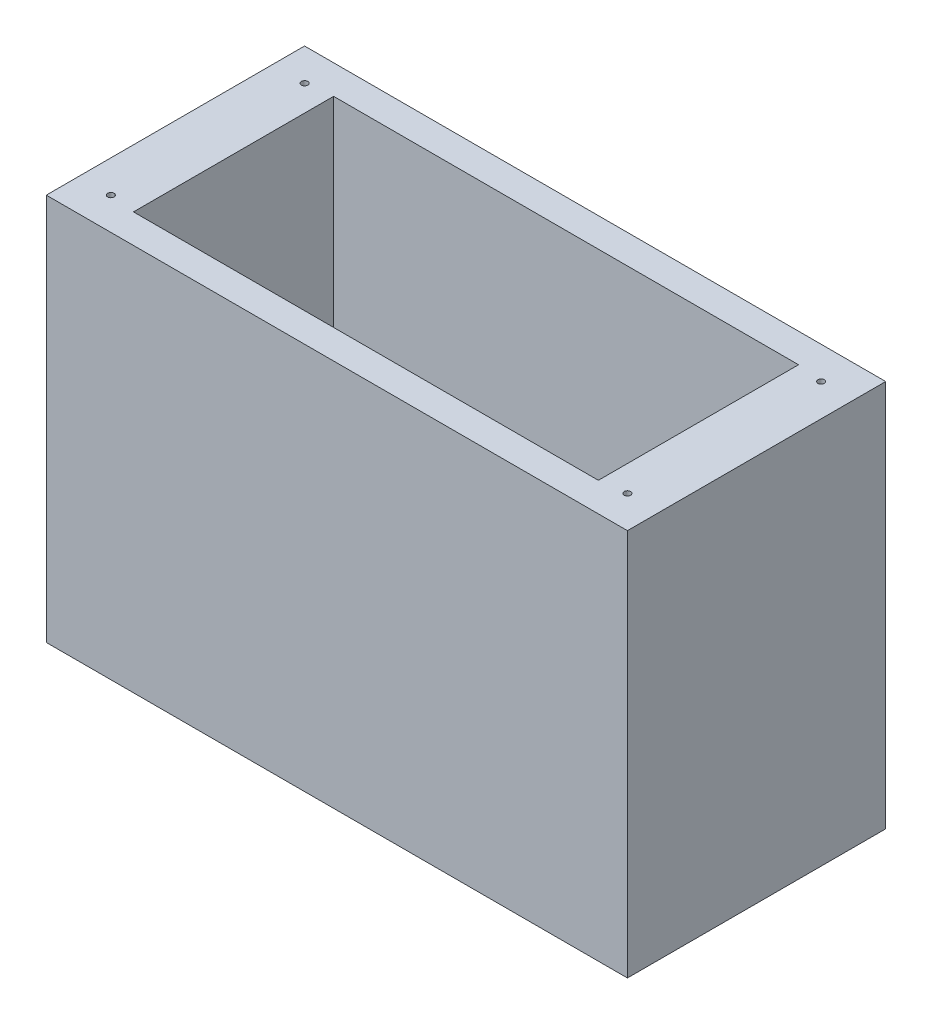
ISO-10303-21;
HEADER;
FILE_DESCRIPTION(('STEP AP214'),'2;1');
FILE_NAME('part.step','',(''),(''),'','','');
FILE_SCHEMA(('AUTOMOTIVE_DESIGN { 1 0 10303 214 1 1 1 1 }'));
ENDSEC;
DATA;
#1=APPLICATION_CONTEXT('core data for automotive mechanical design processes');
#2=APPLICATION_PROTOCOL_DEFINITION('international standard','automotive_design',2000,#1);
#3=PRODUCT_CONTEXT('',#1,'mechanical');
#4=PRODUCT('Part','Part','',(#3));
#5=PRODUCT_RELATED_PRODUCT_CATEGORY('part','',(#4));
#6=PRODUCT_DEFINITION_FORMATION('','',#4);
#7=PRODUCT_DEFINITION_CONTEXT('part definition',#1,'design');
#8=PRODUCT_DEFINITION('design','',#6,#7);
#9=PRODUCT_DEFINITION_SHAPE('','',#8);
#10=(LENGTH_UNIT() NAMED_UNIT(*) SI_UNIT(.MILLI.,.METRE.));
#11=(NAMED_UNIT(*) PLANE_ANGLE_UNIT() SI_UNIT($,.RADIAN.));
#12=(NAMED_UNIT(*) SI_UNIT($,.STERADIAN.) SOLID_ANGLE_UNIT());
#13=UNCERTAINTY_MEASURE_WITH_UNIT(LENGTH_MEASURE(1.E-05),#10,'distance_accuracy_value','');
#14=(GEOMETRIC_REPRESENTATION_CONTEXT(3) GLOBAL_UNCERTAINTY_ASSIGNED_CONTEXT((#13)) GLOBAL_UNIT_ASSIGNED_CONTEXT((#10,
#11,#12)) REPRESENTATION_CONTEXT('',''));
#15=CARTESIAN_POINT('',(0.,0.,0.));
#16=DIRECTION('',(0.,0.,1.));
#17=DIRECTION('',(1.,0.,0.));
#18=AXIS2_PLACEMENT_3D('',#15,#16,#17);
#19=CARTESIAN_POINT('',(0.,152.4,0.));
#20=DIRECTION('',(1.,0.,0.));
#21=DIRECTION('',(0.,0.,-1.));
#22=AXIS2_PLACEMENT_3D('',#19,#20,#21);
#23=PLANE('',#22);
#24=DIRECTION('',(0.,0.,1.));
#25=VECTOR('',#24,1.);
#26=CARTESIAN_POINT('',(0.,0.,0.));
#27=LINE('',#26,#25);
#28=CARTESIAN_POINT('',(0.,0.,-101.6));
#29=VERTEX_POINT('',#28);
#30=CARTESIAN_POINT('',(0.,0.,0.));
#31=VERTEX_POINT('',#30);
#32=EDGE_CURVE('E144',#29,#31,#27,.T.);
#33=ORIENTED_EDGE('',*,*,#32,.T.);
#34=DIRECTION('',(0.,-1.,0.));
#35=VECTOR('',#34,1.);
#36=CARTESIAN_POINT('',(0.,152.4,0.));
#37=LINE('',#36,#35);
#38=CARTESIAN_POINT('',(0.,152.4,0.));
#39=VERTEX_POINT('',#38);
#40=EDGE_CURVE('E11',#39,#31,#37,.T.);
#41=ORIENTED_EDGE('',*,*,#40,.F.);
#42=DIRECTION('',(0.,0.,1.));
#43=VECTOR('',#42,1.);
#44=CARTESIAN_POINT('',(0.,152.4,0.));
#45=LINE('',#44,#43);
#46=CARTESIAN_POINT('',(0.,152.4,-101.6));
#47=VERTEX_POINT('',#46);
#48=EDGE_CURVE('E148',#47,#39,#45,.T.);
#49=ORIENTED_EDGE('',*,*,#48,.F.);
#50=DIRECTION('',(0.,-1.,0.));
#51=VECTOR('',#50,1.);
#52=CARTESIAN_POINT('',(0.,152.4,-101.6));
#53=LINE('',#52,#51);
#54=EDGE_CURVE('E154',#47,#29,#53,.T.);
#55=ORIENTED_EDGE('',*,*,#54,.T.);
#56=EDGE_LOOP('',(#33,#41,#49,#55));
#57=FACE_BOUND('',#56,.T.);
#58=ADVANCED_FACE('F32',(#57),#23,.F.);
#59=CARTESIAN_POINT('',(0.,152.4,0.));
#60=DIRECTION('',(0.,0.,-1.));
#61=DIRECTION('',(-1.,0.,0.));
#62=AXIS2_PLACEMENT_3D('',#59,#60,#61);
#63=PLANE('',#62);
#64=DIRECTION('',(1.,0.,0.));
#65=VECTOR('',#64,1.);
#66=CARTESIAN_POINT('',(0.,0.,0.));
#67=LINE('',#66,#65);
#68=CARTESIAN_POINT('',(228.6,0.,0.));
#69=VERTEX_POINT('',#68);
#70=EDGE_CURVE('E157',#31,#69,#67,.T.);
#71=ORIENTED_EDGE('',*,*,#70,.T.);
#72=DIRECTION('',(0.,-1.,0.));
#73=VECTOR('',#72,1.);
#74=CARTESIAN_POINT('',(228.6,152.4,0.));
#75=LINE('',#74,#73);
#76=CARTESIAN_POINT('',(228.6,152.4,0.));
#77=VERTEX_POINT('',#76);
#78=EDGE_CURVE('E39',#77,#69,#75,.T.);
#79=ORIENTED_EDGE('',*,*,#78,.F.);
#80=DIRECTION('',(1.,0.,0.));
#81=VECTOR('',#80,1.);
#82=CARTESIAN_POINT('',(0.,152.4,0.));
#83=LINE('',#82,#81);
#84=EDGE_CURVE('E83',#39,#77,#83,.T.);
#85=ORIENTED_EDGE('',*,*,#84,.F.);
#86=ORIENTED_EDGE('',*,*,#40,.T.);
#87=EDGE_LOOP('',(#71,#79,#85,#86));
#88=FACE_BOUND('',#87,.T.);
#89=ADVANCED_FACE('F186',(#88),#63,.F.);
#90=CARTESIAN_POINT('',(228.6,152.4,0.));
#91=DIRECTION('',(-1.,0.,0.));
#92=DIRECTION('',(0.,0.,1.));
#93=AXIS2_PLACEMENT_3D('',#90,#91,#92);
#94=PLANE('',#93);
#95=DIRECTION('',(0.,0.,-1.));
#96=VECTOR('',#95,1.);
#97=CARTESIAN_POINT('',(228.6,0.,0.));
#98=LINE('',#97,#96);
#99=CARTESIAN_POINT('',(228.6,0.,-101.6));
#100=VERTEX_POINT('',#99);
#101=EDGE_CURVE('E159',#69,#100,#98,.T.);
#102=ORIENTED_EDGE('',*,*,#101,.T.);
#103=DIRECTION('',(0.,-1.,0.));
#104=VECTOR('',#103,1.);
#105=CARTESIAN_POINT('',(228.6,152.4,-101.6));
#106=LINE('',#105,#104);
#107=CARTESIAN_POINT('',(228.6,152.4,-101.6));
#108=VERTEX_POINT('',#107);
#109=EDGE_CURVE('E163',#108,#100,#106,.T.);
#110=ORIENTED_EDGE('',*,*,#109,.F.);
#111=DIRECTION('',(0.,0.,-1.));
#112=VECTOR('',#111,1.);
#113=CARTESIAN_POINT('',(228.6,152.4,0.));
#114=LINE('',#113,#112);
#115=EDGE_CURVE('E151',#77,#108,#114,.T.);
#116=ORIENTED_EDGE('',*,*,#115,.F.);
#117=ORIENTED_EDGE('',*,*,#78,.T.);
#118=EDGE_LOOP('',(#102,#110,#116,#117));
#119=FACE_BOUND('',#118,.T.);
#120=ADVANCED_FACE('F168',(#119),#94,.F.);
#121=CARTESIAN_POINT('',(0.,152.4,-101.6));
#122=DIRECTION('',(0.,0.,1.));
#123=DIRECTION('',(1.,0.,0.));
#124=AXIS2_PLACEMENT_3D('',#121,#122,#123);
#125=PLANE('',#124);
#126=DIRECTION('',(-1.,0.,0.));
#127=VECTOR('',#126,1.);
#128=CARTESIAN_POINT('',(0.,0.,-101.6));
#129=LINE('',#128,#127);
#130=EDGE_CURVE('E76',#100,#29,#129,.T.);
#131=ORIENTED_EDGE('',*,*,#130,.T.);
#132=ORIENTED_EDGE('',*,*,#54,.F.);
#133=DIRECTION('',(-1.,0.,0.));
#134=VECTOR('',#133,1.);
#135=CARTESIAN_POINT('',(0.,152.4,-101.6));
#136=LINE('',#135,#134);
#137=EDGE_CURVE('E55',#108,#47,#136,.T.);
#138=ORIENTED_EDGE('',*,*,#137,.F.);
#139=ORIENTED_EDGE('',*,*,#109,.T.);
#140=EDGE_LOOP('',(#131,#132,#138,#139));
#141=FACE_BOUND('',#140,.T.);
#142=ADVANCED_FACE('F176',(#141),#125,.F.);
#143=CARTESIAN_POINT('',(0.,152.4,0.));
#144=DIRECTION('',(0.,-1.,0.));
#145=DIRECTION('',(0.,0.,-1.));
#146=AXIS2_PLACEMENT_3D('',#143,#144,#145);
#147=PLANE('',#146);
#148=CARTESIAN_POINT('',(215.9,152.4,-88.8999999999999));
#149=DIRECTION('',(0.,1.,0.));
#150=DIRECTION('',(0.,0.,-1.));
#151=AXIS2_PLACEMENT_3D('',#148,#149,#150);
#152=CIRCLE('',#151,1.27000000000001);
#153=CARTESIAN_POINT('',(215.9,152.4,-90.17));
#154=VERTEX_POINT('',#153);
#155=EDGE_CURVE('E311',#154,#154,#152,.T.);
#156=ORIENTED_EDGE('',*,*,#155,.F.);
#157=EDGE_LOOP('',(#156));
#158=FACE_BOUND('',#157,.T.);
#159=CARTESIAN_POINT('',(12.7,152.4,-12.7));
#160=DIRECTION('',(0.,1.,0.));
#161=DIRECTION('',(0.,0.,-1.));
#162=AXIS2_PLACEMENT_3D('',#159,#160,#161);
#163=CIRCLE('',#162,1.27);
#164=CARTESIAN_POINT('',(12.7,152.4,-13.97));
#165=VERTEX_POINT('',#164);
#166=EDGE_CURVE('E316',#165,#165,#163,.T.);
#167=ORIENTED_EDGE('',*,*,#166,.F.);
#168=EDGE_LOOP('',(#167));
#169=FACE_BOUND('',#168,.T.);
#170=CARTESIAN_POINT('',(215.9,152.4,-12.7));
#171=DIRECTION('',(0.,1.,0.));
#172=DIRECTION('',(0.,0.,1.));
#173=AXIS2_PLACEMENT_3D('',#170,#171,#172);
#174=CIRCLE('',#173,1.27000000000001);
#175=CARTESIAN_POINT('',(215.9,152.4,-11.43));
#176=VERTEX_POINT('',#175);
#177=EDGE_CURVE('E335',#176,#176,#174,.T.);
#178=ORIENTED_EDGE('',*,*,#177,.F.);
#179=EDGE_LOOP('',(#178));
#180=FACE_BOUND('',#179,.T.);
#181=CARTESIAN_POINT('',(12.7,152.4,-88.8999999999999));
#182=DIRECTION('',(0.,1.,0.));
#183=DIRECTION('',(0.,0.,1.));
#184=AXIS2_PLACEMENT_3D('',#181,#182,#183);
#185=CIRCLE('',#184,1.27);
#186=CARTESIAN_POINT('',(12.7,152.4,-87.6299999999999));
#187=VERTEX_POINT('',#186);
#188=EDGE_CURVE('E131',#187,#187,#185,.T.);
#189=ORIENTED_EDGE('',*,*,#188,.F.);
#190=EDGE_LOOP('',(#189));
#191=FACE_BOUND('',#190,.T.);
#192=DIRECTION('',(1.,0.,0.));
#193=VECTOR('',#192,1.);
#194=CARTESIAN_POINT('',(22.86,152.4,-11.43));
#195=LINE('',#194,#193);
#196=CARTESIAN_POINT('',(22.86,152.4,-11.43));
#197=VERTEX_POINT('',#196);
#198=CARTESIAN_POINT('',(205.74,152.4,-11.43));
#199=VERTEX_POINT('',#198);
#200=EDGE_CURVE('E137',#197,#199,#195,.T.);
#201=ORIENTED_EDGE('',*,*,#200,.F.);
#202=DIRECTION('',(0.,0.,1.));
#203=VECTOR('',#202,1.);
#204=CARTESIAN_POINT('',(22.86,152.4,-90.17));
#205=LINE('',#204,#203);
#206=CARTESIAN_POINT('',(22.86,152.4,-90.17));
#207=VERTEX_POINT('',#206);
#208=EDGE_CURVE('E46',#207,#197,#205,.T.);
#209=ORIENTED_EDGE('',*,*,#208,.F.);
#210=DIRECTION('',(-1.,0.,0.));
#211=VECTOR('',#210,1.);
#212=CARTESIAN_POINT('',(22.86,152.4,-90.17));
#213=LINE('',#212,#211);
#214=CARTESIAN_POINT('',(205.74,152.4,-90.17));
#215=VERTEX_POINT('',#214);
#216=EDGE_CURVE('E125',#215,#207,#213,.T.);
#217=ORIENTED_EDGE('',*,*,#216,.F.);
#218=DIRECTION('',(0.,0.,-1.));
#219=VECTOR('',#218,1.);
#220=CARTESIAN_POINT('',(205.74,152.4,-90.17));
#221=LINE('',#220,#219);
#222=EDGE_CURVE('E128',#199,#215,#221,.T.);
#223=ORIENTED_EDGE('',*,*,#222,.F.);
#224=EDGE_LOOP('',(#201,#209,#217,#223));
#225=FACE_BOUND('',#224,.T.);
#226=ORIENTED_EDGE('',*,*,#48,.T.);
#227=ORIENTED_EDGE('',*,*,#84,.T.);
#228=ORIENTED_EDGE('',*,*,#115,.T.);
#229=ORIENTED_EDGE('',*,*,#137,.T.);
#230=EDGE_LOOP('',(#226,#227,#228,#229));
#231=FACE_BOUND('',#230,.T.);
#232=ADVANCED_FACE('F178',(#158,#169,#180,#191,#225,#231),#147,.F.);
#233=CARTESIAN_POINT('',(0.,0.,0.));
#234=DIRECTION('',(0.,-1.,0.));
#235=DIRECTION('',(0.,0.,-1.));
#236=AXIS2_PLACEMENT_3D('',#233,#234,#235);
#237=PLANE('',#236);
#238=CARTESIAN_POINT('',(215.9,0.,-88.8999999999999));
#239=DIRECTION('',(0.,1.,0.));
#240=DIRECTION('',(0.,0.,-1.));
#241=AXIS2_PLACEMENT_3D('',#238,#239,#240);
#242=CIRCLE('',#241,1.27000000000001);
#243=CARTESIAN_POINT('',(215.9,0.,-90.17));
#244=VERTEX_POINT('',#243);
#245=EDGE_CURVE('E308',#244,#244,#242,.T.);
#246=ORIENTED_EDGE('',*,*,#245,.T.);
#247=EDGE_LOOP('',(#246));
#248=FACE_BOUND('',#247,.T.);
#249=CARTESIAN_POINT('',(12.7,0.,-12.7));
#250=DIRECTION('',(0.,1.,0.));
#251=DIRECTION('',(0.,0.,-1.));
#252=AXIS2_PLACEMENT_3D('',#249,#250,#251);
#253=CIRCLE('',#252,1.27);
#254=CARTESIAN_POINT('',(12.7,0.,-13.97));
#255=VERTEX_POINT('',#254);
#256=EDGE_CURVE('E312',#255,#255,#253,.T.);
#257=ORIENTED_EDGE('',*,*,#256,.T.);
#258=EDGE_LOOP('',(#257));
#259=FACE_BOUND('',#258,.T.);
#260=CARTESIAN_POINT('',(215.9,0.,-12.7));
#261=DIRECTION('',(0.,1.,0.));
#262=DIRECTION('',(0.,0.,1.));
#263=AXIS2_PLACEMENT_3D('',#260,#261,#262);
#264=CIRCLE('',#263,1.27000000000001);
#265=CARTESIAN_POINT('',(215.9,0.,-11.43));
#266=VERTEX_POINT('',#265);
#267=EDGE_CURVE('E321',#266,#266,#264,.T.);
#268=ORIENTED_EDGE('',*,*,#267,.T.);
#269=EDGE_LOOP('',(#268));
#270=FACE_BOUND('',#269,.T.);
#271=CARTESIAN_POINT('',(12.7,0.,-88.8999999999999));
#272=DIRECTION('',(0.,1.,0.));
#273=DIRECTION('',(0.,0.,1.));
#274=AXIS2_PLACEMENT_3D('',#271,#272,#273);
#275=CIRCLE('',#274,1.27);
#276=CARTESIAN_POINT('',(12.7,0.,-87.6299999999999));
#277=VERTEX_POINT('',#276);
#278=EDGE_CURVE('E138',#277,#277,#275,.T.);
#279=ORIENTED_EDGE('',*,*,#278,.T.);
#280=EDGE_LOOP('',(#279));
#281=FACE_BOUND('',#280,.T.);
#282=ORIENTED_EDGE('',*,*,#32,.F.);
#283=ORIENTED_EDGE('',*,*,#130,.F.);
#284=ORIENTED_EDGE('',*,*,#101,.F.);
#285=ORIENTED_EDGE('',*,*,#70,.F.);
#286=EDGE_LOOP('',(#282,#283,#284,#285));
#287=FACE_BOUND('',#286,.T.);
#288=ADVANCED_FACE('F172',(#248,#259,#270,#281,#287),#237,.T.);
#289=CARTESIAN_POINT('',(22.86,12.7,-90.17));
#290=DIRECTION('',(-1.,0.,0.));
#291=DIRECTION('',(0.,0.,1.));
#292=AXIS2_PLACEMENT_3D('',#289,#290,#291);
#293=PLANE('',#292);
#294=ORIENTED_EDGE('',*,*,#208,.T.);
#295=DIRECTION('',(0.,1.,0.));
#296=VECTOR('',#295,1.);
#297=CARTESIAN_POINT('',(22.86,12.7,-11.43));
#298=LINE('',#297,#296);
#299=CARTESIAN_POINT('',(22.86,12.7,-11.43));
#300=VERTEX_POINT('',#299);
#301=EDGE_CURVE('E103',#300,#197,#298,.T.);
#302=ORIENTED_EDGE('',*,*,#301,.F.);
#303=DIRECTION('',(0.,0.,1.));
#304=VECTOR('',#303,1.);
#305=CARTESIAN_POINT('',(22.86,12.7,-90.17));
#306=LINE('',#305,#304);
#307=CARTESIAN_POINT('',(22.86,12.7,-90.17));
#308=VERTEX_POINT('',#307);
#309=EDGE_CURVE('E107',#308,#300,#306,.T.);
#310=ORIENTED_EDGE('',*,*,#309,.F.);
#311=DIRECTION('',(0.,1.,0.));
#312=VECTOR('',#311,1.);
#313=CARTESIAN_POINT('',(22.86,12.7,-90.17));
#314=LINE('',#313,#312);
#315=EDGE_CURVE('E142',#308,#207,#314,.T.);
#316=ORIENTED_EDGE('',*,*,#315,.T.);
#317=EDGE_LOOP('',(#294,#302,#310,#316));
#318=FACE_BOUND('',#317,.T.);
#319=ADVANCED_FACE('F105',(#318),#293,.F.);
#320=CARTESIAN_POINT('',(22.86,12.7,-90.17));
#321=DIRECTION('',(0.,0.,-1.));
#322=DIRECTION('',(-1.,0.,0.));
#323=AXIS2_PLACEMENT_3D('',#320,#321,#322);
#324=PLANE('',#323);
#325=ORIENTED_EDGE('',*,*,#216,.T.);
#326=ORIENTED_EDGE('',*,*,#315,.F.);
#327=DIRECTION('',(-1.,0.,0.));
#328=VECTOR('',#327,1.);
#329=CARTESIAN_POINT('',(22.86,12.7,-90.17));
#330=LINE('',#329,#328);
#331=CARTESIAN_POINT('',(205.74,12.7,-90.17));
#332=VERTEX_POINT('',#331);
#333=EDGE_CURVE('E113',#332,#308,#330,.T.);
#334=ORIENTED_EDGE('',*,*,#333,.F.);
#335=DIRECTION('',(0.,1.,0.));
#336=VECTOR('',#335,1.);
#337=CARTESIAN_POINT('',(205.74,12.7,-90.17));
#338=LINE('',#337,#336);
#339=EDGE_CURVE('E145',#332,#215,#338,.T.);
#340=ORIENTED_EDGE('',*,*,#339,.T.);
#341=EDGE_LOOP('',(#325,#326,#334,#340));
#342=FACE_BOUND('',#341,.T.);
#343=ADVANCED_FACE('F213',(#342),#324,.F.);
#344=CARTESIAN_POINT('',(205.74,12.7,-90.17));
#345=DIRECTION('',(1.,0.,0.));
#346=DIRECTION('',(0.,0.,-1.));
#347=AXIS2_PLACEMENT_3D('',#344,#345,#346);
#348=PLANE('',#347);
#349=ORIENTED_EDGE('',*,*,#222,.T.);
#350=ORIENTED_EDGE('',*,*,#339,.F.);
#351=DIRECTION('',(0.,0.,-1.));
#352=VECTOR('',#351,1.);
#353=CARTESIAN_POINT('',(205.74,12.7,-90.17));
#354=LINE('',#353,#352);
#355=CARTESIAN_POINT('',(205.74,12.7,-11.43));
#356=VERTEX_POINT('',#355);
#357=EDGE_CURVE('E121',#356,#332,#354,.T.);
#358=ORIENTED_EDGE('',*,*,#357,.F.);
#359=DIRECTION('',(0.,1.,0.));
#360=VECTOR('',#359,1.);
#361=CARTESIAN_POINT('',(205.74,12.7,-11.43));
#362=LINE('',#361,#360);
#363=EDGE_CURVE('E112',#356,#199,#362,.T.);
#364=ORIENTED_EDGE('',*,*,#363,.T.);
#365=EDGE_LOOP('',(#349,#350,#358,#364));
#366=FACE_BOUND('',#365,.T.);
#367=ADVANCED_FACE('F224',(#366),#348,.F.);
#368=CARTESIAN_POINT('',(22.86,12.7,-11.43));
#369=DIRECTION('',(0.,0.,1.));
#370=DIRECTION('',(1.,0.,0.));
#371=AXIS2_PLACEMENT_3D('',#368,#369,#370);
#372=PLANE('',#371);
#373=ORIENTED_EDGE('',*,*,#200,.T.);
#374=ORIENTED_EDGE('',*,*,#363,.F.);
#375=DIRECTION('',(1.,0.,0.));
#376=VECTOR('',#375,1.);
#377=CARTESIAN_POINT('',(22.86,12.7,-11.43));
#378=LINE('',#377,#376);
#379=EDGE_CURVE('E116',#300,#356,#378,.T.);
#380=ORIENTED_EDGE('',*,*,#379,.F.);
#381=ORIENTED_EDGE('',*,*,#301,.T.);
#382=EDGE_LOOP('',(#373,#374,#380,#381));
#383=FACE_BOUND('',#382,.T.);
#384=ADVANCED_FACE('F117',(#383),#372,.F.);
#385=CARTESIAN_POINT('',(0.,12.7,0.));
#386=DIRECTION('',(0.,1.,0.));
#387=DIRECTION('',(0.,0.,1.));
#388=AXIS2_PLACEMENT_3D('',#385,#386,#387);
#389=PLANE('',#388);
#390=ORIENTED_EDGE('',*,*,#309,.T.);
#391=ORIENTED_EDGE('',*,*,#379,.T.);
#392=ORIENTED_EDGE('',*,*,#357,.T.);
#393=ORIENTED_EDGE('',*,*,#333,.T.);
#394=EDGE_LOOP('',(#390,#391,#392,#393));
#395=FACE_BOUND('',#394,.T.);
#396=ADVANCED_FACE('F123',(#395),#389,.T.);
#397=CARTESIAN_POINT('',(12.7,0.,-88.8999999999999));
#398=DIRECTION('',(0.,1.,0.));
#399=DIRECTION('',(0.,0.,1.));
#400=AXIS2_PLACEMENT_3D('',#397,#398,#399);
#401=CYLINDRICAL_SURFACE('',#400,1.27);
#402=ORIENTED_EDGE('',*,*,#278,.F.);
#403=EDGE_LOOP('',(#402));
#404=FACE_BOUND('',#403,.T.);
#405=ORIENTED_EDGE('',*,*,#188,.T.);
#406=EDGE_LOOP('',(#405));
#407=FACE_BOUND('',#406,.T.);
#408=ADVANCED_FACE('F251',(#404,#407),#401,.F.);
#409=CARTESIAN_POINT('',(215.9,0.,-12.7));
#410=DIRECTION('',(0.,1.,0.));
#411=DIRECTION('',(0.,0.,1.));
#412=AXIS2_PLACEMENT_3D('',#409,#410,#411);
#413=CYLINDRICAL_SURFACE('',#412,1.27000000000001);
#414=ORIENTED_EDGE('',*,*,#267,.F.);
#415=EDGE_LOOP('',(#414));
#416=FACE_BOUND('',#415,.T.);
#417=ORIENTED_EDGE('',*,*,#177,.T.);
#418=EDGE_LOOP('',(#417));
#419=FACE_BOUND('',#418,.T.);
#420=ADVANCED_FACE('F271',(#416,#419),#413,.F.);
#421=CARTESIAN_POINT('',(12.7,0.,-12.7));
#422=DIRECTION('',(0.,1.,0.));
#423=DIRECTION('',(0.,0.,1.));
#424=AXIS2_PLACEMENT_3D('',#421,#422,#423);
#425=CYLINDRICAL_SURFACE('',#424,1.27);
#426=ORIENTED_EDGE('',*,*,#256,.F.);
#427=EDGE_LOOP('',(#426));
#428=FACE_BOUND('',#427,.T.);
#429=ORIENTED_EDGE('',*,*,#166,.T.);
#430=EDGE_LOOP('',(#429));
#431=FACE_BOUND('',#430,.T.);
#432=ADVANCED_FACE('F281',(#428,#431),#425,.F.);
#433=CARTESIAN_POINT('',(215.9,0.,-88.8999999999999));
#434=DIRECTION('',(0.,1.,0.));
#435=DIRECTION('',(0.,0.,1.));
#436=AXIS2_PLACEMENT_3D('',#433,#434,#435);
#437=CYLINDRICAL_SURFACE('',#436,1.27000000000001);
#438=ORIENTED_EDGE('',*,*,#245,.F.);
#439=EDGE_LOOP('',(#438));
#440=FACE_BOUND('',#439,.T.);
#441=ORIENTED_EDGE('',*,*,#155,.T.);
#442=EDGE_LOOP('',(#441));
#443=FACE_BOUND('',#442,.T.);
#444=ADVANCED_FACE('F291',(#440,#443),#437,.F.);
#445=CLOSED_SHELL('',(#58,#89,#120,#142,#232,#288,#319,#343,#367,#384,#396,#408,#420,#432,#444));
#446=MANIFOLD_SOLID_BREP('B2',#445);
#447=ADVANCED_BREP_SHAPE_REPRESENTATION('',(#18,#446),#14);
#448=SHAPE_DEFINITION_REPRESENTATION(#9,#447);
ENDSEC;
END-ISO-10303-21;
